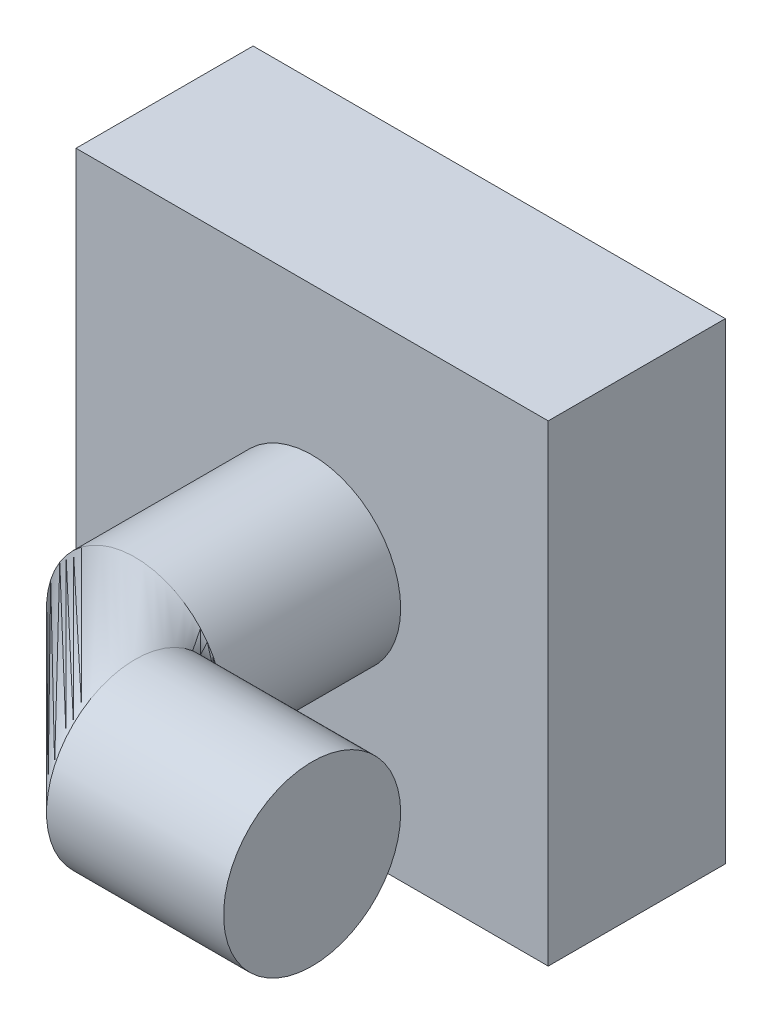
ISO-10303-21;
HEADER;
FILE_DESCRIPTION(('STEP AP214'),'2;1');
FILE_NAME('part.step','',(''),(''),'','','');
FILE_SCHEMA(('AUTOMOTIVE_DESIGN { 1 0 10303 214 1 1 1 1 }'));
ENDSEC;
DATA;
#1=APPLICATION_CONTEXT('core data for automotive mechanical design processes');
#2=APPLICATION_PROTOCOL_DEFINITION('international standard','automotive_design',2000,#1);
#3=PRODUCT_CONTEXT('',#1,'mechanical');
#4=PRODUCT('Part','Part','',(#3));
#5=PRODUCT_RELATED_PRODUCT_CATEGORY('part','',(#4));
#6=PRODUCT_DEFINITION_FORMATION('','',#4);
#7=PRODUCT_DEFINITION_CONTEXT('part definition',#1,'design');
#8=PRODUCT_DEFINITION('design','',#6,#7);
#9=PRODUCT_DEFINITION_SHAPE('','',#8);
#10=(LENGTH_UNIT() NAMED_UNIT(*) SI_UNIT(.MILLI.,.METRE.));
#11=(NAMED_UNIT(*) PLANE_ANGLE_UNIT() SI_UNIT($,.RADIAN.));
#12=(NAMED_UNIT(*) SI_UNIT($,.STERADIAN.) SOLID_ANGLE_UNIT());
#13=UNCERTAINTY_MEASURE_WITH_UNIT(LENGTH_MEASURE(1.E-05),#10,'distance_accuracy_value','');
#14=(GEOMETRIC_REPRESENTATION_CONTEXT(3) GLOBAL_UNCERTAINTY_ASSIGNED_CONTEXT((#13)) GLOBAL_UNIT_ASSIGNED_CONTEXT((#10,
#11,#12)) REPRESENTATION_CONTEXT('',''));
#15=CARTESIAN_POINT('',(0.,0.,0.));
#16=DIRECTION('',(0.,0.,1.));
#17=DIRECTION('',(1.,0.,0.));
#18=AXIS2_PLACEMENT_3D('',#15,#16,#17);
#19=CARTESIAN_POINT('',(57.15,0.,0.));
#20=DIRECTION('',(1.,0.,0.));
#21=DIRECTION('',(0.,0.,-1.));
#22=AXIS2_PLACEMENT_3D('',#19,#20,#21);
#23=PLANE('',#22);
#24=CARTESIAN_POINT('',(57.15,0.,0.));
#25=DIRECTION('',(1.,0.,0.));
#26=DIRECTION('',(0.,0.,-1.));
#27=AXIS2_PLACEMENT_3D('',#24,#25,#26);
#28=CIRCLE('',#27,19.05);
#29=CARTESIAN_POINT('',(57.15,0.,-19.05));
#30=VERTEX_POINT('',#29);
#31=EDGE_CURVE('E116',#30,#30,#28,.T.);
#32=ORIENTED_EDGE('',*,*,#31,.T.);
#33=EDGE_LOOP('',(#32));
#34=FACE_BOUND('',#33,.T.);
#35=ADVANCED_FACE('F34',(#34),#23,.T.);
#36=CARTESIAN_POINT('',(57.15,0.,0.));
#37=DIRECTION('',(-1.,0.,0.));
#38=DIRECTION('',(0.,0.,1.));
#39=AXIS2_PLACEMENT_3D('',#36,#37,#38);
#40=CYLINDRICAL_SURFACE('',#39,19.05);
#41=CARTESIAN_POINT('',(19.05,0.,0.));
#42=DIRECTION('',(1.,0.,0.));
#43=DIRECTION('',(0.,0.,-1.));
#44=AXIS2_PLACEMENT_3D('',#41,#42,#43);
#45=CIRCLE('',#44,19.05);
#46=CARTESIAN_POINT('',(19.05,0.,-19.05));
#47=VERTEX_POINT('',#46);
#48=EDGE_CURVE('E42',#47,#47,#45,.T.);
#49=ORIENTED_EDGE('',*,*,#48,.T.);
#50=EDGE_LOOP('',(#49));
#51=FACE_BOUND('',#50,.T.);
#52=ORIENTED_EDGE('',*,*,#31,.F.);
#53=EDGE_LOOP('',(#52));
#54=FACE_BOUND('',#53,.T.);
#55=ADVANCED_FACE('F120',(#51,#54),#40,.T.);
#56=CARTESIAN_POINT('',(19.05,0.,-19.05));
#57=DIRECTION('',(0.,-1.,0.));
#58=DIRECTION('',(0.,0.,-1.));
#59=AXIS2_PLACEMENT_3D('',#56,#57,#58);
#60=TOROIDAL_SURFACE('',#59,19.05,19.05);
#61=CARTESIAN_POINT('',(0.,0.,-19.05));
#62=DIRECTION('',(0.,0.,1.));
#63=DIRECTION('',(1.,0.,0.));
#64=AXIS2_PLACEMENT_3D('',#61,#62,#63);
#65=CIRCLE('',#64,19.05);
#66=EDGE_CURVE('E11',#47,#47,#65,.T.);
#67=ORIENTED_EDGE('',*,*,#66,.T.);
#68=ORIENTED_EDGE('',*,*,#48,.F.);
#69=EDGE_LOOP('',(#67,#68));
#70=FACE_BOUND('',#69,.T.);
#71=ADVANCED_FACE('F123',(#70),#60,.T.);
#72=CARTESIAN_POINT('',(0.,0.,-19.05));
#73=DIRECTION('',(0.,0.,-1.));
#74=DIRECTION('',(-1.,0.,0.));
#75=AXIS2_PLACEMENT_3D('',#72,#73,#74);
#76=CYLINDRICAL_SURFACE('',#75,19.05);
#77=CARTESIAN_POINT('',(0.,0.,-57.15));
#78=DIRECTION('',(0.,0.,1.));
#79=DIRECTION('',(1.,0.,0.));
#80=AXIS2_PLACEMENT_3D('',#77,#78,#79);
#81=CIRCLE('',#80,19.05);
#82=CARTESIAN_POINT('',(19.05,0.,-57.15));
#83=VERTEX_POINT('',#82);
#84=EDGE_CURVE('E37',#83,#83,#81,.T.);
#85=ORIENTED_EDGE('',*,*,#84,.T.);
#86=EDGE_LOOP('',(#85));
#87=FACE_BOUND('',#86,.T.);
#88=ORIENTED_EDGE('',*,*,#66,.F.);
#89=EDGE_LOOP('',(#88));
#90=FACE_BOUND('',#89,.T.);
#91=ADVANCED_FACE('F125',(#87,#90),#76,.T.);
#92=CARTESIAN_POINT('',(50.8,50.8,-95.25));
#93=DIRECTION('',(-1.,0.,0.));
#94=DIRECTION('',(0.,-1.,0.));
#95=AXIS2_PLACEMENT_3D('',#92,#93,#94);
#96=PLANE('',#95);
#97=DIRECTION('',(0.,-1.,0.));
#98=VECTOR('',#97,1.);
#99=CARTESIAN_POINT('',(50.8,50.8,-57.15));
#100=LINE('',#99,#98);
#101=CARTESIAN_POINT('',(50.8,50.8,-57.15));
#102=VERTEX_POINT('',#101);
#103=CARTESIAN_POINT('',(50.8,-50.8,-57.15));
#104=VERTEX_POINT('',#103);
#105=EDGE_CURVE('E106',#102,#104,#100,.T.);
#106=ORIENTED_EDGE('',*,*,#105,.T.);
#107=DIRECTION('',(0.,0.,1.));
#108=VECTOR('',#107,1.);
#109=CARTESIAN_POINT('',(50.8,-50.8,-95.25));
#110=LINE('',#109,#108);
#111=CARTESIAN_POINT('',(50.8,-50.8,-95.25));
#112=VERTEX_POINT('',#111);
#113=EDGE_CURVE('E97',#112,#104,#110,.T.);
#114=ORIENTED_EDGE('',*,*,#113,.F.);
#115=DIRECTION('',(0.,-1.,0.));
#116=VECTOR('',#115,1.);
#117=CARTESIAN_POINT('',(50.8,50.8,-95.25));
#118=LINE('',#117,#116);
#119=CARTESIAN_POINT('',(50.8,50.8,-95.25));
#120=VERTEX_POINT('',#119);
#121=EDGE_CURVE('E88',#120,#112,#118,.T.);
#122=ORIENTED_EDGE('',*,*,#121,.F.);
#123=DIRECTION('',(0.,0.,1.));
#124=VECTOR('',#123,1.);
#125=CARTESIAN_POINT('',(50.8,50.8,-95.25));
#126=LINE('',#125,#124);
#127=EDGE_CURVE('E102',#120,#102,#126,.T.);
#128=ORIENTED_EDGE('',*,*,#127,.T.);
#129=EDGE_LOOP('',(#106,#114,#122,#128));
#130=FACE_BOUND('',#129,.T.);
#131=ADVANCED_FACE('F127',(#130),#96,.F.);
#132=CARTESIAN_POINT('',(-50.8,-50.8,-95.25));
#133=DIRECTION('',(0.,1.,0.));
#134=DIRECTION('',(-1.,0.,0.));
#135=AXIS2_PLACEMENT_3D('',#132,#133,#134);
#136=PLANE('',#135);
#137=DIRECTION('',(-1.,0.,0.));
#138=VECTOR('',#137,1.);
#139=CARTESIAN_POINT('',(-50.8,-50.8,-57.15));
#140=LINE('',#139,#138);
#141=CARTESIAN_POINT('',(-50.8,-50.8,-57.15));
#142=VERTEX_POINT('',#141);
#143=EDGE_CURVE('E94',#104,#142,#140,.T.);
#144=ORIENTED_EDGE('',*,*,#143,.T.);
#145=DIRECTION('',(0.,0.,1.));
#146=VECTOR('',#145,1.);
#147=CARTESIAN_POINT('',(-50.8,-50.8,-95.25));
#148=LINE('',#147,#146);
#149=CARTESIAN_POINT('',(-50.8,-50.8,-95.25));
#150=VERTEX_POINT('',#149);
#151=EDGE_CURVE('E92',#150,#142,#148,.T.);
#152=ORIENTED_EDGE('',*,*,#151,.F.);
#153=DIRECTION('',(-1.,0.,0.));
#154=VECTOR('',#153,1.);
#155=CARTESIAN_POINT('',(-50.8,-50.8,-95.25));
#156=LINE('',#155,#154);
#157=EDGE_CURVE('E82',#112,#150,#156,.T.);
#158=ORIENTED_EDGE('',*,*,#157,.F.);
#159=ORIENTED_EDGE('',*,*,#113,.T.);
#160=EDGE_LOOP('',(#144,#152,#158,#159));
#161=FACE_BOUND('',#160,.T.);
#162=ADVANCED_FACE('F93',(#161),#136,.F.);
#163=CARTESIAN_POINT('',(-50.8,50.8,-95.25));
#164=DIRECTION('',(1.,0.,0.));
#165=DIRECTION('',(0.,1.,0.));
#166=AXIS2_PLACEMENT_3D('',#163,#164,#165);
#167=PLANE('',#166);
#168=DIRECTION('',(0.,1.,0.));
#169=VECTOR('',#168,1.);
#170=CARTESIAN_POINT('',(-50.8,50.8,-57.15));
#171=LINE('',#170,#169);
#172=CARTESIAN_POINT('',(-50.8,50.8,-57.15));
#173=VERTEX_POINT('',#172);
#174=EDGE_CURVE('E110',#142,#173,#171,.T.);
#175=ORIENTED_EDGE('',*,*,#174,.T.);
#176=DIRECTION('',(0.,0.,1.));
#177=VECTOR('',#176,1.);
#178=CARTESIAN_POINT('',(-50.8,50.8,-95.25));
#179=LINE('',#178,#177);
#180=CARTESIAN_POINT('',(-50.8,50.8,-95.25));
#181=VERTEX_POINT('',#180);
#182=EDGE_CURVE('E98',#181,#173,#179,.T.);
#183=ORIENTED_EDGE('',*,*,#182,.F.);
#184=DIRECTION('',(0.,1.,0.));
#185=VECTOR('',#184,1.);
#186=CARTESIAN_POINT('',(-50.8,50.8,-95.25));
#187=LINE('',#186,#185);
#188=EDGE_CURVE('E85',#150,#181,#187,.T.);
#189=ORIENTED_EDGE('',*,*,#188,.F.);
#190=ORIENTED_EDGE('',*,*,#151,.T.);
#191=EDGE_LOOP('',(#175,#183,#189,#190));
#192=FACE_BOUND('',#191,.T.);
#193=ADVANCED_FACE('F100',(#192),#167,.F.);
#194=CARTESIAN_POINT('',(-50.8,50.8,-95.25));
#195=DIRECTION('',(0.,-1.,0.));
#196=DIRECTION('',(1.,0.,0.));
#197=AXIS2_PLACEMENT_3D('',#194,#195,#196);
#198=PLANE('',#197);
#199=DIRECTION('',(1.,0.,0.));
#200=VECTOR('',#199,1.);
#201=CARTESIAN_POINT('',(-50.8,50.8,-57.15));
#202=LINE('',#201,#200);
#203=EDGE_CURVE('E74',#173,#102,#202,.T.);
#204=ORIENTED_EDGE('',*,*,#203,.T.);
#205=ORIENTED_EDGE('',*,*,#127,.F.);
#206=DIRECTION('',(1.,0.,0.));
#207=VECTOR('',#206,1.);
#208=CARTESIAN_POINT('',(-50.8,50.8,-95.25));
#209=LINE('',#208,#207);
#210=EDGE_CURVE('E54',#181,#120,#209,.T.);
#211=ORIENTED_EDGE('',*,*,#210,.F.);
#212=ORIENTED_EDGE('',*,*,#182,.T.);
#213=EDGE_LOOP('',(#204,#205,#211,#212));
#214=FACE_BOUND('',#213,.T.);
#215=ADVANCED_FACE('F144',(#214),#198,.F.);
#216=CARTESIAN_POINT('',(0.,0.,-95.25));
#217=DIRECTION('',(0.,0.,1.));
#218=DIRECTION('',(1.,0.,0.));
#219=AXIS2_PLACEMENT_3D('',#216,#217,#218);
#220=PLANE('',#219);
#221=ORIENTED_EDGE('',*,*,#121,.T.);
#222=ORIENTED_EDGE('',*,*,#157,.T.);
#223=ORIENTED_EDGE('',*,*,#188,.T.);
#224=ORIENTED_EDGE('',*,*,#210,.T.);
#225=EDGE_LOOP('',(#221,#222,#223,#224));
#226=FACE_BOUND('',#225,.T.);
#227=ADVANCED_FACE('F83',(#226),#220,.F.);
#228=CARTESIAN_POINT('',(0.,0.,-57.15));
#229=DIRECTION('',(0.,0.,1.));
#230=DIRECTION('',(1.,0.,0.));
#231=AXIS2_PLACEMENT_3D('',#228,#229,#230);
#232=PLANE('',#231);
#233=ORIENTED_EDGE('',*,*,#84,.F.);
#234=EDGE_LOOP('',(#233));
#235=FACE_BOUND('',#234,.T.);
#236=ORIENTED_EDGE('',*,*,#105,.F.);
#237=ORIENTED_EDGE('',*,*,#203,.F.);
#238=ORIENTED_EDGE('',*,*,#174,.F.);
#239=ORIENTED_EDGE('',*,*,#143,.F.);
#240=EDGE_LOOP('',(#236,#237,#238,#239));
#241=FACE_BOUND('',#240,.T.);
#242=ADVANCED_FACE('F147',(#235,#241),#232,.T.);
#243=CLOSED_SHELL('',(#35,#55,#71,#91,#131,#162,#193,#215,#227,#242));
#244=MANIFOLD_SOLID_BREP('B2',#243);
#245=ADVANCED_BREP_SHAPE_REPRESENTATION('',(#18,#244),#14);
#246=SHAPE_DEFINITION_REPRESENTATION(#9,#245);
ENDSEC;
END-ISO-10303-21;
